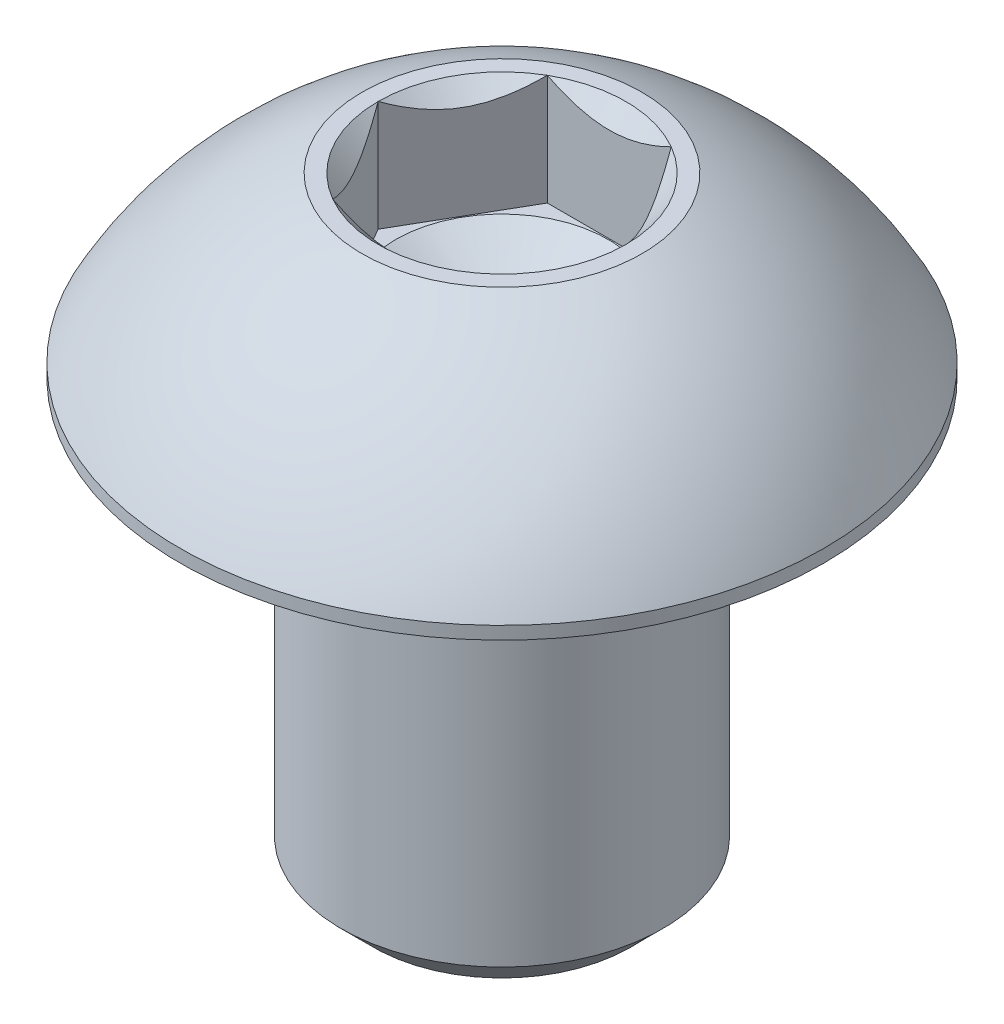
ISO-10303-21;
HEADER;
FILE_DESCRIPTION(('STEP AP214'),'2;1');
FILE_NAME('part.step','',(''),(''),'','','');
FILE_SCHEMA(('AUTOMOTIVE_DESIGN { 1 0 10303 214 1 1 1 1 }'));
ENDSEC;
DATA;
#1=APPLICATION_CONTEXT('core data for automotive mechanical design processes');
#2=APPLICATION_PROTOCOL_DEFINITION('international standard','automotive_design',2000,#1);
#3=PRODUCT_CONTEXT('',#1,'mechanical');
#4=PRODUCT('Part','Part','',(#3));
#5=PRODUCT_RELATED_PRODUCT_CATEGORY('part','',(#4));
#6=PRODUCT_DEFINITION_FORMATION('','',#4);
#7=PRODUCT_DEFINITION_CONTEXT('part definition',#1,'design');
#8=PRODUCT_DEFINITION('design','',#6,#7);
#9=PRODUCT_DEFINITION_SHAPE('','',#8);
#10=(LENGTH_UNIT() NAMED_UNIT(*) SI_UNIT(.MILLI.,.METRE.));
#11=(NAMED_UNIT(*) PLANE_ANGLE_UNIT() SI_UNIT($,.RADIAN.));
#12=(NAMED_UNIT(*) SI_UNIT($,.STERADIAN.) SOLID_ANGLE_UNIT());
#13=UNCERTAINTY_MEASURE_WITH_UNIT(LENGTH_MEASURE(1.E-05),#10,'distance_accuracy_value','');
#14=(GEOMETRIC_REPRESENTATION_CONTEXT(3) GLOBAL_UNCERTAINTY_ASSIGNED_CONTEXT((#13)) GLOBAL_UNIT_ASSIGNED_CONTEXT((#10,
#11,#12)) REPRESENTATION_CONTEXT('',''));
#15=CARTESIAN_POINT('',(0.,0.,0.));
#16=DIRECTION('',(0.,0.,1.));
#17=DIRECTION('',(1.,0.,0.));
#18=AXIS2_PLACEMENT_3D('',#15,#16,#17);
#19=CARTESIAN_POINT('',(0.,-0.329401076758506,0.));
#20=DIRECTION('',(0.,1.,0.));
#21=DIRECTION('',(-1.,0.,0.));
#22=AXIS2_PLACEMENT_3D('',#19,#20,#21);
#23=CONICAL_SURFACE('',#22,1.98,0.785398163397443);
#24=CARTESIAN_POINT('',(1.15458506832541,0.000115478713659794,2.0002));
#25=CARTESIAN_POINT('',(1.19427965103064,-0.0395469097744081,1.9314469659693));
#26=CARTESIAN_POINT('',(1.23463799837204,-0.076880017715839,1.86154425786449));
#27=CARTESIAN_POINT('',(1.31693321846145,-0.145236314863859,1.71900475544957));
#28=CARTESIAN_POINT('',(1.35887791933133,-0.176221466262782,1.64635440243464));
#29=CARTESIAN_POINT('',(1.44345742638069,-0.229299783455862,1.49985839894603));
#30=CARTESIAN_POINT('',(1.48607068799506,-0.251526372823395,1.42605006475371));
#31=CARTESIAN_POINT('',(1.57223542169502,-0.285771183324926,1.27680836816474));
#32=CARTESIAN_POINT('',(1.61578426088223,-0.297814970855872,1.20137956608185));
#33=CARTESIAN_POINT('',(1.69083694766535,-0.308681488094436,1.07138449932892));
#34=CARTESIAN_POINT('',(1.7222438111715,-0.310290246390038,1.0169862160299));
#35=CARTESIAN_POINT('',(1.78500621460363,-0.307581122401298,0.908278544480312));
#36=CARTESIAN_POINT('',(1.81636173267753,-0.303261162242036,0.853969194078668));
#37=CARTESIAN_POINT('',(1.87877671565354,-0.288940432590105,0.74586327241067));
#38=CARTESIAN_POINT('',(1.90983580972305,-0.278933307238005,0.692067343445217));
#39=CARTESIAN_POINT('',(1.97141691651546,-0.253787569750354,0.585405737694437));
#40=CARTESIAN_POINT('',(2.00193897021857,-0.238649350957774,0.532539989929299));
#41=CARTESIAN_POINT('',(2.08012358375726,-0.193705496570824,0.397120266910165));
#42=CARTESIAN_POINT('',(2.12730124240477,-0.160511160574198,0.315406165150529));
#43=CARTESIAN_POINT('',(2.19667172615921,-0.104474176828643,0.195252962742202));
#44=CARTESIAN_POINT('',(2.21953238052244,-0.0847852970530719,0.155657147890826));
#45=CARTESIAN_POINT('',(2.26483018959123,-0.0436126816351395,0.077199041112129));
#46=CARTESIAN_POINT('',(2.2872675941616,-0.0221300483487633,0.0383363164062602));
#47=CARTESIAN_POINT('',(2.30951654681233,0.000115478713650004,-0.000200000000000171));
#48=B_SPLINE_CURVE_WITH_KNOTS('',3,(#24,#25,#26,#27,#28,#29,#30,#31,#32,#33,#34,#35,#36,#37,#38,
#39,#40,#41,#42,#43,#44,#45,#46,#47),.UNSPECIFIED.,.F.,.F.,(4,2,2,2,2,2,2,2,2,2,2,4),(0.,
0.266420613771063,0.534393751523388,0.798110374376914,1.06116288956936,1.24939906803721,
1.43770123566247,1.62621426093931,1.81471283831912,2.11415604834144,2.2634717071779,
2.41269626969771),.UNSPECIFIED.);
#49=CARTESIAN_POINT('',(1.15470053837925,0.,2.));
#50=VERTEX_POINT('',#49);
#51=CARTESIAN_POINT('',(2.3094010767585,0.,0.));
#52=VERTEX_POINT('',#51);
#53=EDGE_CURVE('E94',#50,#52,#48,.T.);
#54=ORIENTED_EDGE('',*,*,#53,.F.);
#55=CARTESIAN_POINT('',(0.,0.,0.));
#56=DIRECTION('',(0.,1.,0.));
#57=DIRECTION('',(-1.,0.,0.));
#58=AXIS2_PLACEMENT_3D('',#55,#56,#57);
#59=CIRCLE('',#58,2.3094010767585);
#60=EDGE_CURVE('E204',#50,#52,#59,.T.);
#61=ORIENTED_EDGE('',*,*,#60,.T.);
#62=EDGE_LOOP('',(#54,#61));
#63=FACE_BOUND('',#62,.T.);
#64=ADVANCED_FACE('F35',(#63),#23,.F.);
#65=CARTESIAN_POINT('',(-2.4016988930378,0.816004108624515,2.));
#66=CARTESIAN_POINT('',(-2.34364374717124,0.771402007369878,2.));
#67=CARTESIAN_POINT('',(-2.28527487460719,0.72720182646706,2.));
#68=CARTESIAN_POINT('',(-2.16778177433703,0.639788658220482,2.));
#69=CARTESIAN_POINT('',(-2.10865737042829,0.596575907964369,2.));
#70=CARTESIAN_POINT('',(-1.98909315289621,0.511013411391249,2.));
#71=CARTESIAN_POINT('',(-1.92864670875566,0.468672900116709,2.));
#72=CARTESIAN_POINT('',(-1.80674624649483,0.385473012060508,2.));
#73=CARTESIAN_POINT('',(-1.74529229829942,0.344613533115885,2.));
#74=CARTESIAN_POINT('',(-1.61729364728598,0.262191941172389,2.));
#75=CARTESIAN_POINT('',(-1.55067237812126,0.220748136041137,2.));
#76=CARTESIAN_POINT('',(-1.41588569542362,0.140456417587909,2.));
#77=CARTESIAN_POINT('',(-1.34772048480282,0.101608165766328,2.));
#78=CARTESIAN_POINT('',(-1.20979979500996,0.0273165006372269,2.));
#79=CARTESIAN_POINT('',(-1.14004948716927,-0.00813643801677666,2.));
#80=CARTESIAN_POINT('',(-0.998582110622184,-0.0748366723380926,2.));
#81=CARTESIAN_POINT('',(-0.92686598626821,-0.106085946201042,2.));
#82=CARTESIAN_POINT('',(-0.788401364906432,-0.160464040919243,2.));
#83=CARTESIAN_POINT('',(-0.721849025830185,-0.184087260688953,2.));
#84=CARTESIAN_POINT('',(-0.58705568426648,-0.226005882119155,2.));
#85=CARTESIAN_POINT('',(-0.518814573927894,-0.244300942546208,2.));
#86=CARTESIAN_POINT('',(-0.382235643148148,-0.274270772453367,2.));
#87=CARTESIAN_POINT('',(-0.31392454174365,-0.286065264518145,2.));
#88=CARTESIAN_POINT('',(-0.176462448313592,-0.302789073296218,2.));
#89=CARTESIAN_POINT('',(-0.107311631072685,-0.307719794790323,2.));
#90=CARTESIAN_POINT('',(0.0281435793608251,-0.310300081084241,2.));
#91=CARTESIAN_POINT('',(0.0944422269462917,-0.308254241039847,2.));
#92=CARTESIAN_POINT('',(0.226518253341805,-0.297691619331899,2.));
#93=CARTESIAN_POINT('',(0.292295583982905,-0.28917424659166,2.));
#94=CARTESIAN_POINT('',(0.423968764982488,-0.266004759268356,2.));
#95=CARTESIAN_POINT('',(0.489845303069303,-0.251244633004259,2.));
#96=CARTESIAN_POINT('',(0.620144930305485,-0.216403666991153,2.));
#97=CARTESIAN_POINT('',(0.684568104786245,-0.196323140505887,2.));
#98=CARTESIAN_POINT('',(0.88313096727538,-0.126762229434683,2.));
#99=CARTESIAN_POINT('',(1.0145494382978,-0.0695411953032019,2.));
#100=CARTESIAN_POINT('',(1.27125638148092,0.057788836311565,2.));
#101=CARTESIAN_POINT('',(1.39652118947232,0.127943300144361,2.));
#102=CARTESIAN_POINT('',(1.57759787989773,0.237497509406799,2.));
#103=CARTESIAN_POINT('',(1.6353691048044,0.27372282950728,2.));
#104=CARTESIAN_POINT('',(1.74991952168509,0.347721106892875,2.));
#105=CARTESIAN_POINT('',(1.80669863876842,0.385494180298591,2.));
#106=CARTESIAN_POINT('',(1.91893732425359,0.461997037773416,2.));
#107=CARTESIAN_POINT('',(1.97440382956914,0.500716695729816,2.));
#108=CARTESIAN_POINT('',(2.08457608632257,0.579193105855199,2.));
#109=CARTESIAN_POINT('',(2.13928204323827,0.618949569220858,2.));
#110=CARTESIAN_POINT('',(2.19366905695503,0.659131208974972,2.));
#111=B_SPLINE_CURVE_WITH_KNOTS('',3,(#65,#66,#67,#68,#69,#70,#71,#72,#73,#74,#75,#76,#77,#78,
#79,#80,#81,#82,#83,#84,#85,#86,#87,#88,#89,#90,#91,#92,#93,#94,#95,#96,#97,#98,#99,#100,#101,
#102,#103,#104,#105,#106,#107,#108,#109,#110),.UNSPECIFIED.,.F.,.F.,(4,2,2,2,2,2,2,2,2,2,2,2,2,
2,2,2,2,2,2,2,2,2,4),(0.,0.21963493933764,0.439322071603268,0.660704792449876,0.882072212939004,
1.11740580841693,1.35270865266656,1.58733074454258,1.82184203684129,2.03352101863876,
2.24521355409826,2.45286457646098,2.66047309345758,2.85913560134509,3.05781625623113,
3.26008495759975,3.462341752087,3.89110251508173,4.321400331068,4.52594905039686,
4.7305131442481,4.93343353072423,5.13629798482758),.UNSPECIFIED.);
#112=CARTESIAN_POINT('',(-1.15470053837925,0.,2.));
#113=VERTEX_POINT('',#112);
#114=EDGE_CURVE('E166',#113,#50,#111,.T.);
#115=ORIENTED_EDGE('',*,*,#114,.F.);
#116=EDGE_CURVE('E43',#113,#50,#59,.T.);
#117=ORIENTED_EDGE('',*,*,#116,.T.);
#118=EDGE_LOOP('',(#115,#117));
#119=FACE_BOUND('',#118,.T.);
#120=ADVANCED_FACE('F214',(#119),#23,.F.);
#121=CARTESIAN_POINT('',(-2.30951654681233,0.00011547871365103,-0.000199999999999566));
#122=CARTESIAN_POINT('',(-2.2698219641071,-0.0395469097744163,0.0685530340307046));
#123=CARTESIAN_POINT('',(-2.22946361676571,-0.0768800177158463,0.138455742135509));
#124=CARTESIAN_POINT('',(-2.1471683966763,-0.145236314863864,0.280995244550432));
#125=CARTESIAN_POINT('',(-2.10522369580641,-0.176221466262786,0.353645597565353));
#126=CARTESIAN_POINT('',(-2.02064418875706,-0.229299783455864,0.500141601053963));
#127=CARTESIAN_POINT('',(-1.97803092714269,-0.251526372823396,0.573949935246285));
#128=CARTESIAN_POINT('',(-1.89186619344273,-0.285771183324927,0.723191631835252));
#129=CARTESIAN_POINT('',(-1.84831735425552,-0.297814970855873,0.798620433918138));
#130=CARTESIAN_POINT('',(-1.7732646674724,-0.308681488094436,0.928615500671063));
#131=CARTESIAN_POINT('',(-1.74185780396625,-0.310290246390038,0.983013783970092));
#132=CARTESIAN_POINT('',(-1.67909540053412,-0.307581122401298,1.09172145551967));
#133=CARTESIAN_POINT('',(-1.64773988246022,-0.303261162242035,1.14603080592132));
#134=CARTESIAN_POINT('',(-1.58532489948421,-0.288940432590105,1.25413672758932));
#135=CARTESIAN_POINT('',(-1.5542658054147,-0.278933307238005,1.30793265655477));
#136=CARTESIAN_POINT('',(-1.49268469862229,-0.253787569750353,1.41459426230555));
#137=CARTESIAN_POINT('',(-1.46216264491918,-0.238649350957774,1.46746001007069));
#138=CARTESIAN_POINT('',(-1.38397803138049,-0.193705496570823,1.60287973308982));
#139=CARTESIAN_POINT('',(-1.33680037273298,-0.160511160574195,1.68459383484946));
#140=CARTESIAN_POINT('',(-1.26742988897853,-0.104474176828638,1.80474703725779));
#141=CARTESIAN_POINT('',(-1.24456923461531,-0.0847852970530661,1.84434285210917));
#142=CARTESIAN_POINT('',(-1.19927142554652,-0.0436126816351318,1.92280095888787));
#143=CARTESIAN_POINT('',(-1.17683402097614,-0.0221300483487547,1.96166368359374));
#144=CARTESIAN_POINT('',(-1.15458506832541,0.000115478713659387,2.0002));
#145=B_SPLINE_CURVE_WITH_KNOTS('',3,(#121,#122,#123,#124,#125,#126,#127,#128,#129,#130,#131,
#132,#133,#134,#135,#136,#137,#138,#139,#140,#141,#142,#143,#144),.UNSPECIFIED.,.F.,.F.,(4,2,2,
2,2,2,2,2,2,2,2,4),(0.,0.266420613771059,0.534393751523379,0.7981103743769,1.06116288956935,
1.24939906803719,1.43770123566245,1.62621426093929,1.8147128383191,2.11415604834143,
2.2634717071779,2.41269626969771),.UNSPECIFIED.);
#146=CARTESIAN_POINT('',(-2.30940107675849,0.,0.));
#147=VERTEX_POINT('',#146);
#148=EDGE_CURVE('E220',#147,#113,#145,.T.);
#149=ORIENTED_EDGE('',*,*,#148,.F.);
#150=EDGE_CURVE('E11',#147,#113,#59,.T.);
#151=ORIENTED_EDGE('',*,*,#150,.T.);
#152=EDGE_LOOP('',(#149,#151));
#153=FACE_BOUND('',#152,.T.);
#154=ADVANCED_FACE('F219',(#153),#23,.F.);
#155=CARTESIAN_POINT('',(-1.15458506832541,0.000115478713659038,-2.0002));
#156=CARTESIAN_POINT('',(-1.19427965103064,-0.0395469097744091,-1.93144696596929));
#157=CARTESIAN_POINT('',(-1.23463799837204,-0.0768800177158399,-1.86154425786449));
#158=CARTESIAN_POINT('',(-1.31693321846145,-0.14523631486386,-1.71900475544956));
#159=CARTESIAN_POINT('',(-1.35887791933133,-0.176221466262783,-1.64635440243464));
#160=CARTESIAN_POINT('',(-1.44345742638069,-0.229299783455862,-1.49985839894603));
#161=CARTESIAN_POINT('',(-1.48607068799506,-0.251526372823394,-1.42605006475371));
#162=CARTESIAN_POINT('',(-1.57223542169502,-0.285771183324926,-1.27680836816474));
#163=CARTESIAN_POINT('',(-1.61578426088223,-0.297814970855872,-1.20137956608185));
#164=CARTESIAN_POINT('',(-1.69083694766535,-0.308681488094436,-1.07138449932892));
#165=CARTESIAN_POINT('',(-1.7222438111715,-0.310290246390038,-1.0169862160299));
#166=CARTESIAN_POINT('',(-1.78500621460363,-0.307581122401298,-0.908278544480314));
#167=CARTESIAN_POINT('',(-1.81636173267753,-0.303261162242036,-0.853969194078669));
#168=CARTESIAN_POINT('',(-1.87877671565354,-0.288940432590105,-0.745863272410672));
#169=CARTESIAN_POINT('',(-1.90983580972305,-0.278933307238005,-0.692067343445219));
#170=CARTESIAN_POINT('',(-1.97141691651546,-0.253787569750354,-0.58540573769444));
#171=CARTESIAN_POINT('',(-2.00193897021857,-0.238649350957774,-0.532539989929301));
#172=CARTESIAN_POINT('',(-2.08012358375725,-0.193705496570824,-0.397120266910168));
#173=CARTESIAN_POINT('',(-2.12730124240477,-0.160511160574198,-0.315406165150531));
#174=CARTESIAN_POINT('',(-2.19667172615921,-0.104474176828643,-0.195252962742203));
#175=CARTESIAN_POINT('',(-2.21953238052244,-0.0847852970530718,-0.155657147890827));
#176=CARTESIAN_POINT('',(-2.26483018959122,-0.0436126816351392,-0.0771990411121297));
#177=CARTESIAN_POINT('',(-2.2872675941616,-0.0221300483487629,-0.0383363164062604));
#178=CARTESIAN_POINT('',(-2.30951654681233,0.000115478713650577,0.000200000000000378));
#179=B_SPLINE_CURVE_WITH_KNOTS('',3,(#155,#156,#157,#158,#159,#160,#161,#162,#163,#164,#165,
#166,#167,#168,#169,#170,#171,#172,#173,#174,#175,#176,#177,#178),.UNSPECIFIED.,.F.,.F.,(4,2,2,
2,2,2,2,2,2,2,2,4),(0.,0.266420613771063,0.534393751523387,0.798110374376912,1.06116288956936,
1.24939906803721,1.43770123566246,1.6262142609393,1.81471283831911,2.11415604834144,
2.2634717071779,2.41269626969771),.UNSPECIFIED.);
#180=CARTESIAN_POINT('',(-1.15470053837925,0.,-2.));
#181=VERTEX_POINT('',#180);
#182=EDGE_CURVE('E222',#181,#147,#179,.T.);
#183=ORIENTED_EDGE('',*,*,#182,.F.);
#184=EDGE_CURVE('E44',#181,#147,#59,.T.);
#185=ORIENTED_EDGE('',*,*,#184,.T.);
#186=EDGE_LOOP('',(#183,#185));
#187=FACE_BOUND('',#186,.T.);
#188=ADVANCED_FACE('F254',(#187),#23,.F.);
#189=CARTESIAN_POINT('',(-2.4016988930378,0.816004108624515,-2.));
#190=CARTESIAN_POINT('',(-2.34364374717124,0.771402007369878,-2.));
#191=CARTESIAN_POINT('',(-2.28527487460719,0.72720182646706,-2.));
#192=CARTESIAN_POINT('',(-2.16778177433703,0.639788658220482,-2.));
#193=CARTESIAN_POINT('',(-2.10865737042829,0.59657590796437,-2.));
#194=CARTESIAN_POINT('',(-1.98909315289621,0.511013411391249,-2.));
#195=CARTESIAN_POINT('',(-1.92864670875566,0.468672900116709,-2.));
#196=CARTESIAN_POINT('',(-1.80674624649483,0.385473012060508,-2.));
#197=CARTESIAN_POINT('',(-1.74529229829942,0.344613533115885,-2.));
#198=CARTESIAN_POINT('',(-1.61729364728598,0.262191941172389,-2.));
#199=CARTESIAN_POINT('',(-1.55067237812126,0.220748136041138,-2.));
#200=CARTESIAN_POINT('',(-1.41588569542362,0.140456417587909,-2.));
#201=CARTESIAN_POINT('',(-1.34772048480282,0.101608165766328,-2.));
#202=CARTESIAN_POINT('',(-1.20979979500996,0.0273165006372265,-2.));
#203=CARTESIAN_POINT('',(-1.14004948716927,-0.00813643801677706,-2.));
#204=CARTESIAN_POINT('',(-0.998582110622185,-0.0748366723380931,-2.));
#205=CARTESIAN_POINT('',(-0.926865986268211,-0.106085946201043,-2.));
#206=CARTESIAN_POINT('',(-0.788401364906433,-0.160464040919244,-2.));
#207=CARTESIAN_POINT('',(-0.721849025830186,-0.184087260688954,-2.));
#208=CARTESIAN_POINT('',(-0.587055684266481,-0.226005882119156,-2.));
#209=CARTESIAN_POINT('',(-0.518814573927894,-0.244300942546209,-2.));
#210=CARTESIAN_POINT('',(-0.382235643148149,-0.274270772453368,-2.));
#211=CARTESIAN_POINT('',(-0.313924541743651,-0.286065264518146,-2.));
#212=CARTESIAN_POINT('',(-0.176462448313593,-0.302789073296219,-2.));
#213=CARTESIAN_POINT('',(-0.107311631072685,-0.307719794790325,-2.));
#214=CARTESIAN_POINT('',(0.0281435793608245,-0.310300081084242,-2.));
#215=CARTESIAN_POINT('',(0.0944422269462911,-0.308254241039847,-2.));
#216=CARTESIAN_POINT('',(0.226518253341805,-0.2976916193319,-2.));
#217=CARTESIAN_POINT('',(0.292295583982904,-0.289174246591661,-2.));
#218=CARTESIAN_POINT('',(0.423968764982488,-0.266004759268358,-2.));
#219=CARTESIAN_POINT('',(0.489845303069303,-0.25124463300426,-2.));
#220=CARTESIAN_POINT('',(0.620144930305485,-0.216403666991155,-2.));
#221=CARTESIAN_POINT('',(0.684568104786244,-0.196323140505888,-2.));
#222=CARTESIAN_POINT('',(0.88313096727538,-0.126762229434684,-2.));
#223=CARTESIAN_POINT('',(1.0145494382978,-0.0695411953032032,-2.));
#224=CARTESIAN_POINT('',(1.27125638148091,0.0577888363115637,-2.));
#225=CARTESIAN_POINT('',(1.39652118947232,0.12794330014436,-2.));
#226=CARTESIAN_POINT('',(1.57759787989773,0.237497509406797,-2.));
#227=CARTESIAN_POINT('',(1.6353691048044,0.273722829507279,-2.));
#228=CARTESIAN_POINT('',(1.74991952168508,0.347721106892873,-2.));
#229=CARTESIAN_POINT('',(1.80669863876842,0.385494180298589,-2.));
#230=CARTESIAN_POINT('',(1.91893732425358,0.461997037773414,-2.));
#231=CARTESIAN_POINT('',(1.97440382956914,0.500716695729814,-2.));
#232=CARTESIAN_POINT('',(2.08457608632257,0.579193105855197,-2.));
#233=CARTESIAN_POINT('',(2.13928204323827,0.618949569220856,-2.));
#234=CARTESIAN_POINT('',(2.19366905695503,0.65913120897497,-2.));
#235=B_SPLINE_CURVE_WITH_KNOTS('',3,(#189,#190,#191,#192,#193,#194,#195,#196,#197,#198,#199,
#200,#201,#202,#203,#204,#205,#206,#207,#208,#209,#210,#211,#212,#213,#214,#215,#216,#217,#218,
#219,#220,#221,#222,#223,#224,#225,#226,#227,#228,#229,#230,#231,#232,#233,#234),.UNSPECIFIED.,
.F.,.F.,(4,2,2,2,2,2,2,2,2,2,2,2,2,2,2,2,2,2,2,2,2,2,4),(0.,0.21963493933764,0.439322071603268,
0.660704792449875,0.882072212939003,1.11740580841693,1.35270865266656,1.58733074454258,
1.82184203684129,2.03352101863876,2.24521355409826,2.45286457646098,2.66047309345758,
2.85913560134509,3.05781625623113,3.26008495759975,3.462341752087,3.89110251508173,
4.321400331068,4.52594905039686,4.7305131442481,4.93343353072422,5.13629798482758),.UNSPECIFIED.);
#236=CARTESIAN_POINT('',(1.15470053837925,0.,-2.));
#237=VERTEX_POINT('',#236);
#238=EDGE_CURVE('E138',#237,#181,#235,.F.);
#239=ORIENTED_EDGE('',*,*,#238,.F.);
#240=EDGE_CURVE('E193',#237,#181,#59,.T.);
#241=ORIENTED_EDGE('',*,*,#240,.T.);
#242=EDGE_LOOP('',(#239,#241));
#243=FACE_BOUND('',#242,.T.);
#244=ADVANCED_FACE('F248',(#243),#23,.F.);
#245=CARTESIAN_POINT('',(2.30951654681233,0.000115478713649501,0.000199999999999783));
#246=CARTESIAN_POINT('',(2.2698219641071,-0.0395469097744173,-0.0685530340307046));
#247=CARTESIAN_POINT('',(2.22946361676571,-0.0768800177158471,-0.138455742135509));
#248=CARTESIAN_POINT('',(2.1471683966763,-0.145236314863865,-0.280995244550431));
#249=CARTESIAN_POINT('',(2.10522369580641,-0.176221466262787,-0.353645597565352));
#250=CARTESIAN_POINT('',(2.02064418875706,-0.229299783455865,-0.500141601053962));
#251=CARTESIAN_POINT('',(1.97803092714269,-0.251526372823397,-0.573949935246284));
#252=CARTESIAN_POINT('',(1.89186619344273,-0.285771183324927,-0.723191631835251));
#253=CARTESIAN_POINT('',(1.84831735425552,-0.297814970855873,-0.798620433918137));
#254=CARTESIAN_POINT('',(1.7732646674724,-0.308681488094437,-0.928615500671062));
#255=CARTESIAN_POINT('',(1.74185780396625,-0.310290246390038,-0.983013783970091));
#256=CARTESIAN_POINT('',(1.67909540053412,-0.307581122401298,-1.09172145551967));
#257=CARTESIAN_POINT('',(1.64773988246022,-0.303261162242036,-1.14603080592132));
#258=CARTESIAN_POINT('',(1.58532489948421,-0.288940432590105,-1.25413672758932));
#259=CARTESIAN_POINT('',(1.5542658054147,-0.278933307238005,-1.30793265655477));
#260=CARTESIAN_POINT('',(1.49268469862229,-0.253787569750354,-1.41459426230555));
#261=CARTESIAN_POINT('',(1.46216264491918,-0.238649350957774,-1.46746001007069));
#262=CARTESIAN_POINT('',(1.3839780313805,-0.193705496570823,-1.60287973308982));
#263=CARTESIAN_POINT('',(1.33680037273298,-0.160511160574195,-1.68459383484946));
#264=CARTESIAN_POINT('',(1.26742988897854,-0.104474176828638,-1.80474703725779));
#265=CARTESIAN_POINT('',(1.24456923461531,-0.0847852970530664,-1.84434285210917));
#266=CARTESIAN_POINT('',(1.19927142554652,-0.0436126816351323,-1.92280095888787));
#267=CARTESIAN_POINT('',(1.17683402097614,-0.0221300483487552,-1.96166368359374));
#268=CARTESIAN_POINT('',(1.15458506832541,0.000115478713658839,-2.0002));
#269=B_SPLINE_CURVE_WITH_KNOTS('',3,(#245,#246,#247,#248,#249,#250,#251,#252,#253,#254,#255,
#256,#257,#258,#259,#260,#261,#262,#263,#264,#265,#266,#267,#268),.UNSPECIFIED.,.F.,.F.,(4,2,2,
2,2,2,2,2,2,2,2,4),(0.,0.266420613771059,0.534393751523378,0.798110374376899,1.06116288956934,
1.24939906803719,1.43770123566245,1.62621426093928,1.8147128383191,2.11415604834143,
2.26347170717789,2.4126962696977),.UNSPECIFIED.);
#270=EDGE_CURVE('E122',#52,#237,#269,.T.);
#271=ORIENTED_EDGE('',*,*,#270,.F.);
#272=EDGE_CURVE('E199',#52,#237,#59,.T.);
#273=ORIENTED_EDGE('',*,*,#272,.T.);
#274=EDGE_LOOP('',(#271,#273));
#275=FACE_BOUND('',#274,.T.);
#276=ADVANCED_FACE('F144',(#275),#23,.F.);
#277=CARTESIAN_POINT('',(2.6094010767585,0.,0.));
#278=DIRECTION('',(0.,1.,0.));
#279=DIRECTION('',(-1.,0.,0.));
#280=AXIS2_PLACEMENT_3D('',#277,#278,#279);
#281=PLANE('',#280);
#282=CARTESIAN_POINT('',(0.,0.,0.));
#283=DIRECTION('',(0.,1.,0.));
#284=DIRECTION('',(-1.,0.,0.));
#285=AXIS2_PLACEMENT_3D('',#282,#283,#284);
#286=CIRCLE('',#285,2.6094010767585);
#287=CARTESIAN_POINT('',(-2.6094010767585,0.,0.));
#288=VERTEX_POINT('',#287);
#289=EDGE_CURVE('E188',#288,#288,#286,.T.);
#290=ORIENTED_EDGE('',*,*,#289,.T.);
#291=EDGE_LOOP('',(#290));
#292=FACE_BOUND('',#291,.T.);
#293=ORIENTED_EDGE('',*,*,#150,.F.);
#294=ORIENTED_EDGE('',*,*,#184,.F.);
#295=ORIENTED_EDGE('',*,*,#240,.F.);
#296=ORIENTED_EDGE('',*,*,#272,.F.);
#297=ORIENTED_EDGE('',*,*,#60,.F.);
#298=ORIENTED_EDGE('',*,*,#116,.F.);
#299=EDGE_LOOP('',(#293,#294,#295,#296,#297,#298));
#300=FACE_BOUND('',#299,.T.);
#301=ADVANCED_FACE('F216',(#292,#300),#281,.T.);
#302=CARTESIAN_POINT('',(0.,-6.29834710881009,0.));
#303=DIRECTION('',(0.,1.,0.));
#304=DIRECTION('',(1.,0.,0.));
#305=AXIS2_PLACEMENT_3D('',#302,#303,#304);
#306=SPHERICAL_SURFACE('',#305,6.81748856122582);
#307=CARTESIAN_POINT('',(0.,-3.06135,0.));
#308=DIRECTION('',(0.,1.,0.));
#309=DIRECTION('',(-1.,0.,0.));
#310=AXIS2_PLACEMENT_3D('',#307,#308,#309);
#311=CIRCLE('',#310,6.);
#312=CARTESIAN_POINT('',(-6.,-3.06135,0.));
#313=VERTEX_POINT('',#312);
#314=EDGE_CURVE('E186',#313,#313,#311,.T.);
#315=ORIENTED_EDGE('',*,*,#314,.T.);
#316=EDGE_LOOP('',(#315));
#317=FACE_BOUND('',#316,.T.);
#318=ORIENTED_EDGE('',*,*,#289,.F.);
#319=EDGE_LOOP('',(#318));
#320=FACE_BOUND('',#319,.T.);
#321=ADVANCED_FACE('F253',(#317,#320),#306,.T.);
#322=CARTESIAN_POINT('',(0.,0.,0.));
#323=DIRECTION('',(0.,1.,0.));
#324=DIRECTION('',(-1.,0.,0.));
#325=AXIS2_PLACEMENT_3D('',#322,#323,#324);
#326=CYLINDRICAL_SURFACE('',#325,6.);
#327=CARTESIAN_POINT('',(0.,-3.3,0.));
#328=DIRECTION('',(0.,1.,0.));
#329=DIRECTION('',(-1.,0.,0.));
#330=AXIS2_PLACEMENT_3D('',#327,#328,#329);
#331=CIRCLE('',#330,6.);
#332=CARTESIAN_POINT('',(-6.,-3.3,0.));
#333=VERTEX_POINT('',#332);
#334=EDGE_CURVE('E183',#333,#333,#331,.T.);
#335=ORIENTED_EDGE('',*,*,#334,.T.);
#336=EDGE_LOOP('',(#335));
#337=FACE_BOUND('',#336,.T.);
#338=ORIENTED_EDGE('',*,*,#314,.F.);
#339=EDGE_LOOP('',(#338));
#340=FACE_BOUND('',#339,.T.);
#341=ADVANCED_FACE('F310',(#337,#340),#326,.T.);
#342=CARTESIAN_POINT('',(3.,-3.3,0.));
#343=DIRECTION('',(0.,-1.,0.));
#344=DIRECTION('',(1.,0.,0.));
#345=AXIS2_PLACEMENT_3D('',#342,#343,#344);
#346=PLANE('',#345);
#347=CARTESIAN_POINT('',(0.,-3.3,0.));
#348=DIRECTION('',(0.,1.,0.));
#349=DIRECTION('',(-1.,0.,0.));
#350=AXIS2_PLACEMENT_3D('',#347,#348,#349);
#351=CIRCLE('',#350,3.);
#352=CARTESIAN_POINT('',(-3.,-3.3,0.));
#353=VERTEX_POINT('',#352);
#354=EDGE_CURVE('E180',#353,#353,#351,.T.);
#355=ORIENTED_EDGE('',*,*,#354,.T.);
#356=EDGE_LOOP('',(#355));
#357=FACE_BOUND('',#356,.T.);
#358=ORIENTED_EDGE('',*,*,#334,.F.);
#359=EDGE_LOOP('',(#358));
#360=FACE_BOUND('',#359,.T.);
#361=ADVANCED_FACE('F321',(#357,#360),#346,.T.);
#362=CARTESIAN_POINT('',(0.,0.,0.));
#363=DIRECTION('',(0.,1.,0.));
#364=DIRECTION('',(-1.,0.,0.));
#365=AXIS2_PLACEMENT_3D('',#362,#363,#364);
#366=CYLINDRICAL_SURFACE('',#365,3.);
#367=CARTESIAN_POINT('',(0.,-10.7,0.));
#368=DIRECTION('',(0.,1.,0.));
#369=DIRECTION('',(-1.,0.,0.));
#370=AXIS2_PLACEMENT_3D('',#367,#368,#369);
#371=CIRCLE('',#370,3.);
#372=CARTESIAN_POINT('',(-3.,-10.7,0.));
#373=VERTEX_POINT('',#372);
#374=EDGE_CURVE('E177',#373,#373,#371,.T.);
#375=ORIENTED_EDGE('',*,*,#374,.T.);
#376=EDGE_LOOP('',(#375));
#377=FACE_BOUND('',#376,.T.);
#378=ORIENTED_EDGE('',*,*,#354,.F.);
#379=EDGE_LOOP('',(#378));
#380=FACE_BOUND('',#379,.T.);
#381=ADVANCED_FACE('F331',(#377,#380),#366,.T.);
#382=CARTESIAN_POINT('',(0.,-10.7,0.));
#383=DIRECTION('',(0.,1.,0.));
#384=DIRECTION('',(-1.,0.,0.));
#385=AXIS2_PLACEMENT_3D('',#382,#383,#384);
#386=CONICAL_SURFACE('',#385,3.,0.785398163397444);
#387=CARTESIAN_POINT('',(0.,-11.3,0.));
#388=DIRECTION('',(0.,1.,0.));
#389=DIRECTION('',(-1.,0.,0.));
#390=AXIS2_PLACEMENT_3D('',#387,#388,#389);
#391=CIRCLE('',#390,2.40000000000001);
#392=CARTESIAN_POINT('',(-2.40000000000001,-11.3,0.));
#393=VERTEX_POINT('',#392);
#394=EDGE_CURVE('E174',#393,#393,#391,.T.);
#395=ORIENTED_EDGE('',*,*,#394,.T.);
#396=EDGE_LOOP('',(#395));
#397=FACE_BOUND('',#396,.T.);
#398=ORIENTED_EDGE('',*,*,#374,.F.);
#399=EDGE_LOOP('',(#398));
#400=FACE_BOUND('',#399,.T.);
#401=ADVANCED_FACE('F341',(#397,#400),#386,.T.);
#402=CARTESIAN_POINT('',(0.,-11.3,0.));
#403=DIRECTION('',(0.,-1.,0.));
#404=DIRECTION('',(1.,0.,0.));
#405=AXIS2_PLACEMENT_3D('',#402,#403,#404);
#406=PLANE('',#405);
#407=ORIENTED_EDGE('',*,*,#394,.F.);
#408=EDGE_LOOP('',(#407));
#409=FACE_BOUND('',#408,.T.);
#410=ADVANCED_FACE('F157',(#409),#406,.T.);
#411=CARTESIAN_POINT('',(1.15470053837925,-2.0625,2.));
#412=DIRECTION('',(0.86602540378444,0.,0.499999999999997));
#413=DIRECTION('',(0.499999999999997,0.,-0.86602540378444));
#414=AXIS2_PLACEMENT_3D('',#411,#412,#413);
#415=PLANE('',#414);
#416=ORIENTED_EDGE('',*,*,#53,.T.);
#417=DIRECTION('',(0.,1.,0.));
#418=VECTOR('',#417,1.);
#419=CARTESIAN_POINT('',(2.30940107675849,-2.0625,0.));
#420=LINE('',#419,#418);
#421=CARTESIAN_POINT('',(2.30940107675849,-2.0625,0.));
#422=VERTEX_POINT('',#421);
#423=EDGE_CURVE('E51',#422,#52,#420,.T.);
#424=ORIENTED_EDGE('',*,*,#423,.F.);
#425=DIRECTION('',(0.499999999999997,0.,-0.86602540378444));
#426=VECTOR('',#425,1.);
#427=CARTESIAN_POINT('',(1.15470053837925,-2.0625,2.));
#428=LINE('',#427,#426);
#429=CARTESIAN_POINT('',(1.15470053837925,-2.0625,2.));
#430=VERTEX_POINT('',#429);
#431=EDGE_CURVE('E91',#430,#422,#428,.T.);
#432=ORIENTED_EDGE('',*,*,#431,.F.);
#433=DIRECTION('',(0.,1.,0.));
#434=VECTOR('',#433,1.);
#435=CARTESIAN_POINT('',(1.15470053837925,-2.0625,2.));
#436=LINE('',#435,#434);
#437=EDGE_CURVE('E120',#430,#50,#436,.T.);
#438=ORIENTED_EDGE('',*,*,#437,.T.);
#439=EDGE_LOOP('',(#416,#424,#432,#438));
#440=FACE_BOUND('',#439,.T.);
#441=ADVANCED_FACE('F88',(#440),#415,.F.);
#442=CARTESIAN_POINT('',(1.15470053837925,-2.0625,2.));
#443=DIRECTION('',(0.,0.,1.));
#444=DIRECTION('',(1.,0.,0.));
#445=AXIS2_PLACEMENT_3D('',#442,#443,#444);
#446=PLANE('',#445);
#447=ORIENTED_EDGE('',*,*,#114,.T.);
#448=ORIENTED_EDGE('',*,*,#437,.F.);
#449=DIRECTION('',(1.,0.,0.));
#450=VECTOR('',#449,1.);
#451=CARTESIAN_POINT('',(1.15470053837925,-2.0625,2.));
#452=LINE('',#451,#450);
#453=CARTESIAN_POINT('',(-1.15470053837925,-2.0625,2.));
#454=VERTEX_POINT('',#453);
#455=EDGE_CURVE('E97',#454,#430,#452,.T.);
#456=ORIENTED_EDGE('',*,*,#455,.F.);
#457=DIRECTION('',(0.,1.,0.));
#458=VECTOR('',#457,1.);
#459=CARTESIAN_POINT('',(-1.15470053837925,-2.0625,2.));
#460=LINE('',#459,#458);
#461=EDGE_CURVE('E123',#454,#113,#460,.T.);
#462=ORIENTED_EDGE('',*,*,#461,.T.);
#463=EDGE_LOOP('',(#447,#448,#456,#462));
#464=FACE_BOUND('',#463,.T.);
#465=ADVANCED_FACE('F156',(#464),#446,.F.);
#466=CARTESIAN_POINT('',(-1.15470053837925,-2.0625,2.));
#467=DIRECTION('',(-0.86602540378444,0.,0.499999999999998));
#468=DIRECTION('',(0.499999999999998,0.,0.86602540378444));
#469=AXIS2_PLACEMENT_3D('',#466,#467,#468);
#470=PLANE('',#469);
#471=ORIENTED_EDGE('',*,*,#148,.T.);
#472=ORIENTED_EDGE('',*,*,#461,.F.);
#473=DIRECTION('',(0.499999999999998,0.,0.86602540378444));
#474=VECTOR('',#473,1.);
#475=CARTESIAN_POINT('',(-1.15470053837925,-2.0625,2.));
#476=LINE('',#475,#474);
#477=CARTESIAN_POINT('',(-2.30940107675849,-2.0625,0.));
#478=VERTEX_POINT('',#477);
#479=EDGE_CURVE('E117',#478,#454,#476,.T.);
#480=ORIENTED_EDGE('',*,*,#479,.F.);
#481=DIRECTION('',(0.,1.,0.));
#482=VECTOR('',#481,1.);
#483=CARTESIAN_POINT('',(-2.30940107675849,-2.0625,0.));
#484=LINE('',#483,#482);
#485=EDGE_CURVE('E126',#478,#147,#484,.T.);
#486=ORIENTED_EDGE('',*,*,#485,.T.);
#487=EDGE_LOOP('',(#471,#472,#480,#486));
#488=FACE_BOUND('',#487,.T.);
#489=ADVANCED_FACE('F230',(#488),#470,.F.);
#490=CARTESIAN_POINT('',(-1.15470053837925,-2.0625,-2.));
#491=DIRECTION('',(-0.86602540378444,0.,-0.499999999999997));
#492=DIRECTION('',(-0.499999999999998,0.,0.86602540378444));
#493=AXIS2_PLACEMENT_3D('',#490,#491,#492);
#494=PLANE('',#493);
#495=ORIENTED_EDGE('',*,*,#182,.T.);
#496=ORIENTED_EDGE('',*,*,#485,.F.);
#497=DIRECTION('',(-0.499999999999998,0.,0.86602540378444));
#498=VECTOR('',#497,1.);
#499=CARTESIAN_POINT('',(-1.15470053837925,-2.0625,-2.));
#500=LINE('',#499,#498);
#501=CARTESIAN_POINT('',(-1.15470053837925,-2.0625,-2.));
#502=VERTEX_POINT('',#501);
#503=EDGE_CURVE('E114',#502,#478,#500,.T.);
#504=ORIENTED_EDGE('',*,*,#503,.F.);
#505=DIRECTION('',(0.,1.,0.));
#506=VECTOR('',#505,1.);
#507=CARTESIAN_POINT('',(-1.15470053837925,-2.0625,-2.));
#508=LINE('',#507,#506);
#509=EDGE_CURVE('E129',#502,#181,#508,.T.);
#510=ORIENTED_EDGE('',*,*,#509,.T.);
#511=EDGE_LOOP('',(#495,#496,#504,#510));
#512=FACE_BOUND('',#511,.T.);
#513=ADVANCED_FACE('F233',(#512),#494,.F.);
#514=CARTESIAN_POINT('',(1.15470053837925,-2.0625,-2.));
#515=DIRECTION('',(0.,0.,-1.));
#516=DIRECTION('',(-1.,0.,0.));
#517=AXIS2_PLACEMENT_3D('',#514,#515,#516);
#518=PLANE('',#517);
#519=ORIENTED_EDGE('',*,*,#238,.T.);
#520=ORIENTED_EDGE('',*,*,#509,.F.);
#521=DIRECTION('',(-1.,0.,0.));
#522=VECTOR('',#521,1.);
#523=CARTESIAN_POINT('',(1.15470053837925,-2.0625,-2.));
#524=LINE('',#523,#522);
#525=CARTESIAN_POINT('',(1.15470053837925,-2.0625,-2.));
#526=VERTEX_POINT('',#525);
#527=EDGE_CURVE('E106',#526,#502,#524,.T.);
#528=ORIENTED_EDGE('',*,*,#527,.F.);
#529=DIRECTION('',(0.,1.,0.));
#530=VECTOR('',#529,1.);
#531=CARTESIAN_POINT('',(1.15470053837925,-2.0625,-2.));
#532=LINE('',#531,#530);
#533=EDGE_CURVE('E96',#526,#237,#532,.T.);
#534=ORIENTED_EDGE('',*,*,#533,.T.);
#535=EDGE_LOOP('',(#519,#520,#528,#534));
#536=FACE_BOUND('',#535,.T.);
#537=ADVANCED_FACE('F150',(#536),#518,.F.);
#538=CARTESIAN_POINT('',(1.15470053837925,-2.0625,-2.));
#539=DIRECTION('',(0.86602540378444,0.,-0.499999999999997));
#540=DIRECTION('',(-0.499999999999997,0.,-0.86602540378444));
#541=AXIS2_PLACEMENT_3D('',#538,#539,#540);
#542=PLANE('',#541);
#543=ORIENTED_EDGE('',*,*,#270,.T.);
#544=ORIENTED_EDGE('',*,*,#533,.F.);
#545=DIRECTION('',(-0.499999999999997,0.,-0.86602540378444));
#546=VECTOR('',#545,1.);
#547=CARTESIAN_POINT('',(1.15470053837925,-2.0625,-2.));
#548=LINE('',#547,#546);
#549=EDGE_CURVE('E100',#422,#526,#548,.T.);
#550=ORIENTED_EDGE('',*,*,#549,.F.);
#551=ORIENTED_EDGE('',*,*,#423,.T.);
#552=EDGE_LOOP('',(#543,#544,#550,#551));
#553=FACE_BOUND('',#552,.T.);
#554=ADVANCED_FACE('F101',(#553),#542,.F.);
#555=CARTESIAN_POINT('',(3.46410161513774,-2.0625,-2.));
#556=DIRECTION('',(0.,1.,0.));
#557=DIRECTION('',(0.,0.,1.));
#558=AXIS2_PLACEMENT_3D('',#555,#556,#557);
#559=PLANE('',#558);
#560=CARTESIAN_POINT('',(0.,-2.0625,0.));
#561=DIRECTION('',(0.,1.,0.));
#562=DIRECTION('',(0.,0.,1.));
#563=AXIS2_PLACEMENT_3D('',#560,#561,#562);
#564=CIRCLE('',#563,1.98);
#565=CARTESIAN_POINT('',(0.,-2.0625,1.98));
#566=VERTEX_POINT('',#565);
#567=EDGE_CURVE('E165',#566,#566,#564,.T.);
#568=ORIENTED_EDGE('',*,*,#567,.F.);
#569=EDGE_LOOP('',(#568));
#570=FACE_BOUND('',#569,.T.);
#571=ORIENTED_EDGE('',*,*,#431,.T.);
#572=ORIENTED_EDGE('',*,*,#549,.T.);
#573=ORIENTED_EDGE('',*,*,#527,.T.);
#574=ORIENTED_EDGE('',*,*,#503,.T.);
#575=ORIENTED_EDGE('',*,*,#479,.T.);
#576=ORIENTED_EDGE('',*,*,#455,.T.);
#577=EDGE_LOOP('',(#571,#572,#573,#574,#575,#576));
#578=FACE_BOUND('',#577,.T.);
#579=ADVANCED_FACE('F108',(#570,#578),#559,.T.);
#580=CARTESIAN_POINT('',(0.,-3.25220402567456,0.));
#581=DIRECTION('',(0.,1.,0.));
#582=DIRECTION('',(-1.,0.,0.));
#583=AXIS2_PLACEMENT_3D('',#580,#581,#582);
#584=CONICAL_SURFACE('',#583,0.,1.02974425867666);
#585=ORIENTED_EDGE('',*,*,#567,.T.);
#586=EDGE_LOOP('',(#585));
#587=FACE_BOUND('',#586,.T.);
#588=CARTESIAN_POINT('',(0.,-3.25220402567456,0.));
#589=VERTEX_POINT('',#588);
#590=VERTEX_LOOP('',#589);
#591=FACE_BOUND('',#590,.T.);
#592=ADVANCED_FACE('F37',(#587,#591),#584,.F.);
#593=CLOSED_SHELL('',(#64,#120,#154,#188,#244,#276,#301,#321,#341,#361,#381,#401,#410,#441,#465,
#489,#513,#537,#554,#579,#592));
#594=MANIFOLD_SOLID_BREP('B2',#593);
#595=ADVANCED_BREP_SHAPE_REPRESENTATION('',(#18,#594),#14);
#596=SHAPE_DEFINITION_REPRESENTATION(#9,#595);
ENDSEC;
END-ISO-10303-21;
